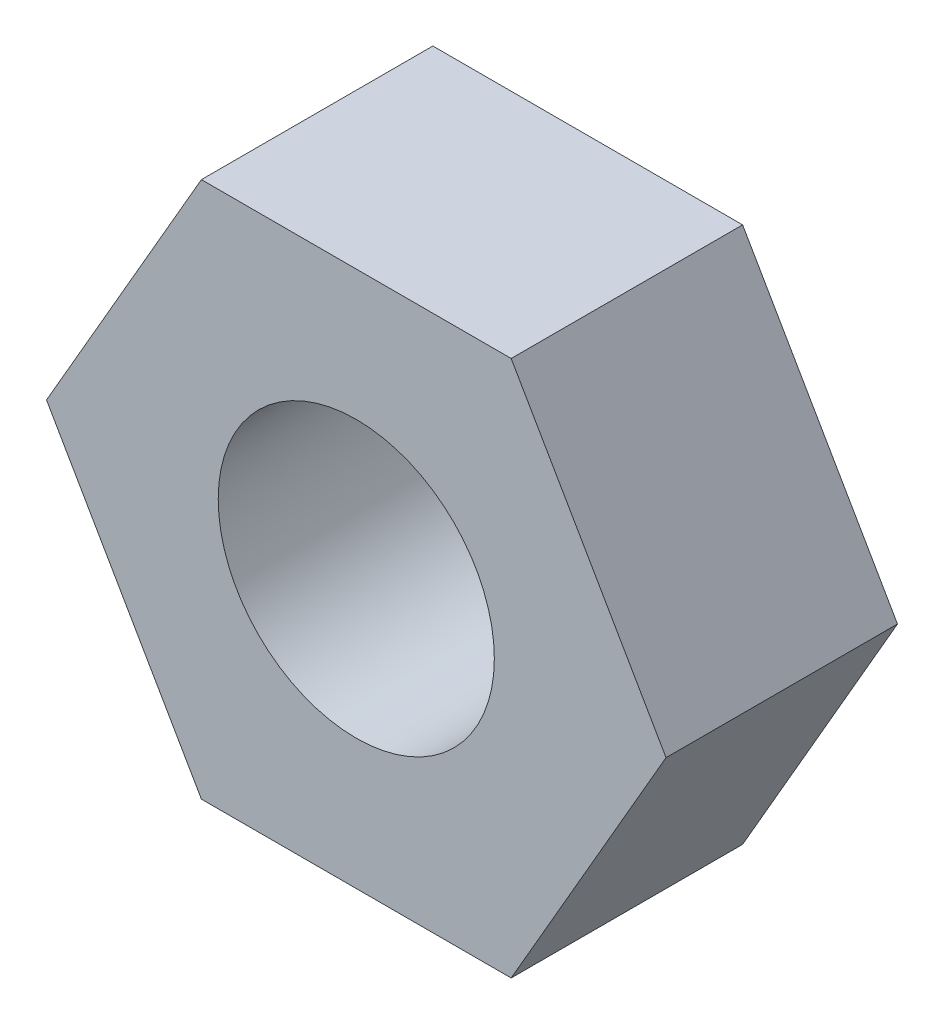
ISO-10303-21;
HEADER;
FILE_DESCRIPTION(('STEP AP214'),'2;1');
FILE_NAME('part.step','',(''),(''),'','','');
FILE_SCHEMA(('AUTOMOTIVE_DESIGN { 1 0 10303 214 1 1 1 1 }'));
ENDSEC;
DATA;
#1=APPLICATION_CONTEXT('core data for automotive mechanical design processes');
#2=APPLICATION_PROTOCOL_DEFINITION('international standard','automotive_design',2000,#1);
#3=PRODUCT_CONTEXT('',#1,'mechanical');
#4=PRODUCT('Part','Part','',(#3));
#5=PRODUCT_RELATED_PRODUCT_CATEGORY('part','',(#4));
#6=PRODUCT_DEFINITION_FORMATION('','',#4);
#7=PRODUCT_DEFINITION_CONTEXT('part definition',#1,'design');
#8=PRODUCT_DEFINITION('design','',#6,#7);
#9=PRODUCT_DEFINITION_SHAPE('','',#8);
#10=(LENGTH_UNIT() NAMED_UNIT(*) SI_UNIT(.MILLI.,.METRE.));
#11=(NAMED_UNIT(*) PLANE_ANGLE_UNIT() SI_UNIT($,.RADIAN.));
#12=(NAMED_UNIT(*) SI_UNIT($,.STERADIAN.) SOLID_ANGLE_UNIT());
#13=UNCERTAINTY_MEASURE_WITH_UNIT(LENGTH_MEASURE(1.E-05),#10,'distance_accuracy_value','');
#14=(GEOMETRIC_REPRESENTATION_CONTEXT(3) GLOBAL_UNCERTAINTY_ASSIGNED_CONTEXT((#13)) GLOBAL_UNIT_ASSIGNED_CONTEXT((#10,
#11,#12)) REPRESENTATION_CONTEXT('',''));
#15=CARTESIAN_POINT('',(0.,0.,0.));
#16=DIRECTION('',(0.,0.,1.));
#17=DIRECTION('',(1.,0.,0.));
#18=AXIS2_PLACEMENT_3D('',#15,#16,#17);
#19=CARTESIAN_POINT('',(0.,0.,1.6764));
#20=DIRECTION('',(0.,0.,1.));
#21=DIRECTION('',(1.,0.,0.));
#22=AXIS2_PLACEMENT_3D('',#19,#20,#21);
#23=PLANE('',#22);
#24=DIRECTION('',(0.499999999999995,0.866025403784441,0.));
#25=VECTOR('',#24,1.);
#26=CARTESIAN_POINT('',(1.12184930806239,-1.94309999999999,1.6764));
#27=LINE('',#26,#25);
#28=CARTESIAN_POINT('',(1.12184930806239,-1.94309999999999,1.6764));
#29=VERTEX_POINT('',#28);
#30=CARTESIAN_POINT('',(2.24369861612473,0.,1.6764));
#31=VERTEX_POINT('',#30);
#32=EDGE_CURVE('E150',#29,#31,#27,.T.);
#33=ORIENTED_EDGE('',*,*,#32,.T.);
#34=DIRECTION('',(-0.500000000000001,0.866025403784438,0.));
#35=VECTOR('',#34,1.);
#36=CARTESIAN_POINT('',(2.24369861612473,0.,1.6764));
#37=LINE('',#36,#35);
#38=CARTESIAN_POINT('',(1.12184930806236,1.9431,1.6764));
#39=VERTEX_POINT('',#38);
#40=EDGE_CURVE('E98',#31,#39,#37,.T.);
#41=ORIENTED_EDGE('',*,*,#40,.T.);
#42=DIRECTION('',(-1.,0.,0.));
#43=VECTOR('',#42,1.);
#44=CARTESIAN_POINT('',(1.12184930806236,1.9431,1.6764));
#45=LINE('',#44,#43);
#46=CARTESIAN_POINT('',(-1.12184930806237,1.9431,1.6764));
#47=VERTEX_POINT('',#46);
#48=EDGE_CURVE('E111',#39,#47,#45,.T.);
#49=ORIENTED_EDGE('',*,*,#48,.T.);
#50=DIRECTION('',(-0.499999999999995,-0.866025403784442,0.));
#51=VECTOR('',#50,1.);
#52=CARTESIAN_POINT('',(-1.12184930806237,1.9431,1.6764));
#53=LINE('',#52,#51);
#54=CARTESIAN_POINT('',(-2.24369861612473,0.,1.6764));
#55=VERTEX_POINT('',#54);
#56=EDGE_CURVE('E105',#47,#55,#53,.T.);
#57=ORIENTED_EDGE('',*,*,#56,.T.);
#58=DIRECTION('',(0.500000000000007,-0.866025403784435,0.));
#59=VECTOR('',#58,1.);
#60=CARTESIAN_POINT('',(-2.24369861612473,0.,1.6764));
#61=LINE('',#60,#59);
#62=CARTESIAN_POINT('',(-1.12184930806234,-1.94310000000001,1.6764));
#63=VERTEX_POINT('',#62);
#64=EDGE_CURVE('E109',#55,#63,#61,.T.);
#65=ORIENTED_EDGE('',*,*,#64,.T.);
#66=DIRECTION('',(1.,0.,0.));
#67=VECTOR('',#66,1.);
#68=CARTESIAN_POINT('',(-1.12184930806234,-1.94310000000001,1.6764));
#69=LINE('',#68,#67);
#70=EDGE_CURVE('E61',#63,#29,#69,.T.);
#71=ORIENTED_EDGE('',*,*,#70,.T.);
#72=EDGE_LOOP('',(#33,#41,#49,#57,#65,#71));
#73=FACE_BOUND('',#72,.T.);
#74=CARTESIAN_POINT('',(0.,0.,1.6764));
#75=DIRECTION('',(0.,0.,1.));
#76=DIRECTION('',(1.,0.,0.));
#77=AXIS2_PLACEMENT_3D('',#74,#75,#76);
#78=CIRCLE('',#77,1.);
#79=CARTESIAN_POINT('',(1.,0.,1.6764));
#80=VERTEX_POINT('',#79);
#81=EDGE_CURVE('E138',#80,#80,#78,.T.);
#82=ORIENTED_EDGE('',*,*,#81,.F.);
#83=EDGE_LOOP('',(#82));
#84=FACE_BOUND('',#83,.T.);
#85=ADVANCED_FACE('F43',(#73,#84),#23,.T.);
#86=CARTESIAN_POINT('',(0.,0.,0.));
#87=DIRECTION('',(0.,0.,1.));
#88=DIRECTION('',(1.,0.,0.));
#89=AXIS2_PLACEMENT_3D('',#86,#87,#88);
#90=PLANE('',#89);
#91=DIRECTION('',(0.499999999999995,0.866025403784441,0.));
#92=VECTOR('',#91,1.);
#93=CARTESIAN_POINT('',(1.12184930806239,-1.94309999999999,0.));
#94=LINE('',#93,#92);
#95=CARTESIAN_POINT('',(1.12184930806239,-1.94309999999999,0.));
#96=VERTEX_POINT('',#95);
#97=CARTESIAN_POINT('',(2.24369861612473,0.,0.));
#98=VERTEX_POINT('',#97);
#99=EDGE_CURVE('E133',#96,#98,#94,.T.);
#100=ORIENTED_EDGE('',*,*,#99,.F.);
#101=DIRECTION('',(1.,0.,0.));
#102=VECTOR('',#101,1.);
#103=CARTESIAN_POINT('',(-1.12184930806234,-1.94310000000001,0.));
#104=LINE('',#103,#102);
#105=CARTESIAN_POINT('',(-1.12184930806234,-1.94310000000001,0.));
#106=VERTEX_POINT('',#105);
#107=EDGE_CURVE('E90',#106,#96,#104,.T.);
#108=ORIENTED_EDGE('',*,*,#107,.F.);
#109=DIRECTION('',(0.500000000000007,-0.866025403784435,0.));
#110=VECTOR('',#109,1.);
#111=CARTESIAN_POINT('',(-2.24369861612473,0.,0.));
#112=LINE('',#111,#110);
#113=CARTESIAN_POINT('',(-2.24369861612473,0.,0.));
#114=VERTEX_POINT('',#113);
#115=EDGE_CURVE('E84',#114,#106,#112,.T.);
#116=ORIENTED_EDGE('',*,*,#115,.F.);
#117=DIRECTION('',(-0.499999999999995,-0.866025403784442,0.));
#118=VECTOR('',#117,1.);
#119=CARTESIAN_POINT('',(-1.12184930806237,1.9431,0.));
#120=LINE('',#119,#118);
#121=CARTESIAN_POINT('',(-1.12184930806237,1.9431,0.));
#122=VERTEX_POINT('',#121);
#123=EDGE_CURVE('E120',#122,#114,#120,.T.);
#124=ORIENTED_EDGE('',*,*,#123,.F.);
#125=DIRECTION('',(-1.,0.,0.));
#126=VECTOR('',#125,1.);
#127=CARTESIAN_POINT('',(1.12184930806236,1.9431,0.));
#128=LINE('',#127,#126);
#129=CARTESIAN_POINT('',(1.12184930806236,1.9431,0.));
#130=VERTEX_POINT('',#129);
#131=EDGE_CURVE('E141',#130,#122,#128,.T.);
#132=ORIENTED_EDGE('',*,*,#131,.F.);
#133=DIRECTION('',(-0.500000000000001,0.866025403784438,0.));
#134=VECTOR('',#133,1.);
#135=CARTESIAN_POINT('',(2.24369861612473,0.,0.));
#136=LINE('',#135,#134);
#137=EDGE_CURVE('E137',#98,#130,#136,.T.);
#138=ORIENTED_EDGE('',*,*,#137,.F.);
#139=EDGE_LOOP('',(#100,#108,#116,#124,#132,#138));
#140=FACE_BOUND('',#139,.T.);
#141=CARTESIAN_POINT('',(0.,0.,0.));
#142=DIRECTION('',(0.,0.,1.));
#143=DIRECTION('',(1.,0.,0.));
#144=AXIS2_PLACEMENT_3D('',#141,#142,#143);
#145=CIRCLE('',#144,1.);
#146=CARTESIAN_POINT('',(1.,0.,0.));
#147=VERTEX_POINT('',#146);
#148=EDGE_CURVE('E247',#147,#147,#145,.T.);
#149=ORIENTED_EDGE('',*,*,#148,.T.);
#150=EDGE_LOOP('',(#149));
#151=FACE_BOUND('',#150,.T.);
#152=ADVANCED_FACE('F163',(#140,#151),#90,.F.);
#153=CARTESIAN_POINT('',(1.12184930806239,-1.94309999999999,1.6764));
#154=DIRECTION('',(-0.866025403784441,0.499999999999995,0.));
#155=DIRECTION('',(-0.499999999999995,-0.866025403784442,0.));
#156=AXIS2_PLACEMENT_3D('',#153,#154,#155);
#157=PLANE('',#156);
#158=ORIENTED_EDGE('',*,*,#99,.T.);
#159=DIRECTION('',(0.,0.,-1.));
#160=VECTOR('',#159,1.);
#161=CARTESIAN_POINT('',(2.24369861612473,0.,1.6764));
#162=LINE('',#161,#160);
#163=EDGE_CURVE('E11',#31,#98,#162,.T.);
#164=ORIENTED_EDGE('',*,*,#163,.F.);
#165=ORIENTED_EDGE('',*,*,#32,.F.);
#166=DIRECTION('',(0.,0.,-1.));
#167=VECTOR('',#166,1.);
#168=CARTESIAN_POINT('',(1.12184930806239,-1.94309999999999,1.6764));
#169=LINE('',#168,#167);
#170=EDGE_CURVE('E129',#29,#96,#169,.T.);
#171=ORIENTED_EDGE('',*,*,#170,.T.);
#172=EDGE_LOOP('',(#158,#164,#165,#171));
#173=FACE_BOUND('',#172,.T.);
#174=ADVANCED_FACE('F45',(#173),#157,.F.);
#175=CARTESIAN_POINT('',(2.24369861612473,0.,1.6764));
#176=DIRECTION('',(-0.866025403784438,-0.500000000000001,0.));
#177=DIRECTION('',(0.500000000000001,-0.866025403784438,0.));
#178=AXIS2_PLACEMENT_3D('',#175,#176,#177);
#179=PLANE('',#178);
#180=ORIENTED_EDGE('',*,*,#137,.T.);
#181=DIRECTION('',(0.,0.,-1.));
#182=VECTOR('',#181,1.);
#183=CARTESIAN_POINT('',(1.12184930806236,1.9431,1.6764));
#184=LINE('',#183,#182);
#185=EDGE_CURVE('E53',#39,#130,#184,.T.);
#186=ORIENTED_EDGE('',*,*,#185,.F.);
#187=ORIENTED_EDGE('',*,*,#40,.F.);
#188=ORIENTED_EDGE('',*,*,#163,.T.);
#189=EDGE_LOOP('',(#180,#186,#187,#188));
#190=FACE_BOUND('',#189,.T.);
#191=ADVANCED_FACE('F188',(#190),#179,.F.);
#192=CARTESIAN_POINT('',(1.12184930806236,1.9431,1.6764));
#193=DIRECTION('',(0.,-1.,0.));
#194=DIRECTION('',(1.,0.,0.));
#195=AXIS2_PLACEMENT_3D('',#192,#193,#194);
#196=PLANE('',#195);
#197=ORIENTED_EDGE('',*,*,#131,.T.);
#198=DIRECTION('',(0.,0.,-1.));
#199=VECTOR('',#198,1.);
#200=CARTESIAN_POINT('',(-1.12184930806237,1.9431,1.6764));
#201=LINE('',#200,#199);
#202=EDGE_CURVE('E122',#47,#122,#201,.T.);
#203=ORIENTED_EDGE('',*,*,#202,.F.);
#204=ORIENTED_EDGE('',*,*,#48,.F.);
#205=ORIENTED_EDGE('',*,*,#185,.T.);
#206=EDGE_LOOP('',(#197,#203,#204,#205));
#207=FACE_BOUND('',#206,.T.);
#208=ADVANCED_FACE('F160',(#207),#196,.F.);
#209=CARTESIAN_POINT('',(-1.12184930806237,1.9431,1.6764));
#210=DIRECTION('',(0.866025403784441,-0.499999999999995,0.));
#211=DIRECTION('',(0.499999999999995,0.866025403784442,0.));
#212=AXIS2_PLACEMENT_3D('',#209,#210,#211);
#213=PLANE('',#212);
#214=ORIENTED_EDGE('',*,*,#123,.T.);
#215=DIRECTION('',(0.,0.,-1.));
#216=VECTOR('',#215,1.);
#217=CARTESIAN_POINT('',(-2.24369861612473,0.,1.6764));
#218=LINE('',#217,#216);
#219=EDGE_CURVE('E117',#55,#114,#218,.T.);
#220=ORIENTED_EDGE('',*,*,#219,.F.);
#221=ORIENTED_EDGE('',*,*,#56,.F.);
#222=ORIENTED_EDGE('',*,*,#202,.T.);
#223=EDGE_LOOP('',(#214,#220,#221,#222));
#224=FACE_BOUND('',#223,.T.);
#225=ADVANCED_FACE('F118',(#224),#213,.F.);
#226=CARTESIAN_POINT('',(-2.24369861612473,0.,1.6764));
#227=DIRECTION('',(0.866025403784435,0.500000000000007,0.));
#228=DIRECTION('',(-0.500000000000007,0.866025403784435,0.));
#229=AXIS2_PLACEMENT_3D('',#226,#227,#228);
#230=PLANE('',#229);
#231=ORIENTED_EDGE('',*,*,#115,.T.);
#232=DIRECTION('',(0.,0.,-1.));
#233=VECTOR('',#232,1.);
#234=CARTESIAN_POINT('',(-1.12184930806234,-1.94310000000001,1.6764));
#235=LINE('',#234,#233);
#236=EDGE_CURVE('E123',#63,#106,#235,.T.);
#237=ORIENTED_EDGE('',*,*,#236,.F.);
#238=ORIENTED_EDGE('',*,*,#64,.F.);
#239=ORIENTED_EDGE('',*,*,#219,.T.);
#240=EDGE_LOOP('',(#231,#237,#238,#239));
#241=FACE_BOUND('',#240,.T.);
#242=ADVANCED_FACE('F125',(#241),#230,.F.);
#243=CARTESIAN_POINT('',(-1.12184930806234,-1.94310000000001,1.6764));
#244=DIRECTION('',(0.,1.,0.));
#245=DIRECTION('',(-1.,0.,0.));
#246=AXIS2_PLACEMENT_3D('',#243,#244,#245);
#247=PLANE('',#246);
#248=ORIENTED_EDGE('',*,*,#107,.T.);
#249=ORIENTED_EDGE('',*,*,#170,.F.);
#250=ORIENTED_EDGE('',*,*,#70,.F.);
#251=ORIENTED_EDGE('',*,*,#236,.T.);
#252=EDGE_LOOP('',(#248,#249,#250,#251));
#253=FACE_BOUND('',#252,.T.);
#254=ADVANCED_FACE('F168',(#253),#247,.F.);
#255=CARTESIAN_POINT('',(0.,0.,1.6764));
#256=DIRECTION('',(0.,0.,-1.));
#257=DIRECTION('',(-1.,0.,0.));
#258=AXIS2_PLACEMENT_3D('',#255,#256,#257);
#259=CYLINDRICAL_SURFACE('',#258,1.);
#260=ORIENTED_EDGE('',*,*,#81,.T.);
#261=EDGE_LOOP('',(#260));
#262=FACE_BOUND('',#261,.T.);
#263=ORIENTED_EDGE('',*,*,#148,.F.);
#264=EDGE_LOOP('',(#263));
#265=FACE_BOUND('',#264,.T.);
#266=ADVANCED_FACE('F170',(#262,#265),#259,.F.);
#267=CLOSED_SHELL('',(#85,#152,#174,#191,#208,#225,#242,#254,#266));
#268=MANIFOLD_SOLID_BREP('B2',#267);
#269=ADVANCED_BREP_SHAPE_REPRESENTATION('',(#18,#268),#14);
#270=SHAPE_DEFINITION_REPRESENTATION(#9,#269);
ENDSEC;
END-ISO-10303-21;
